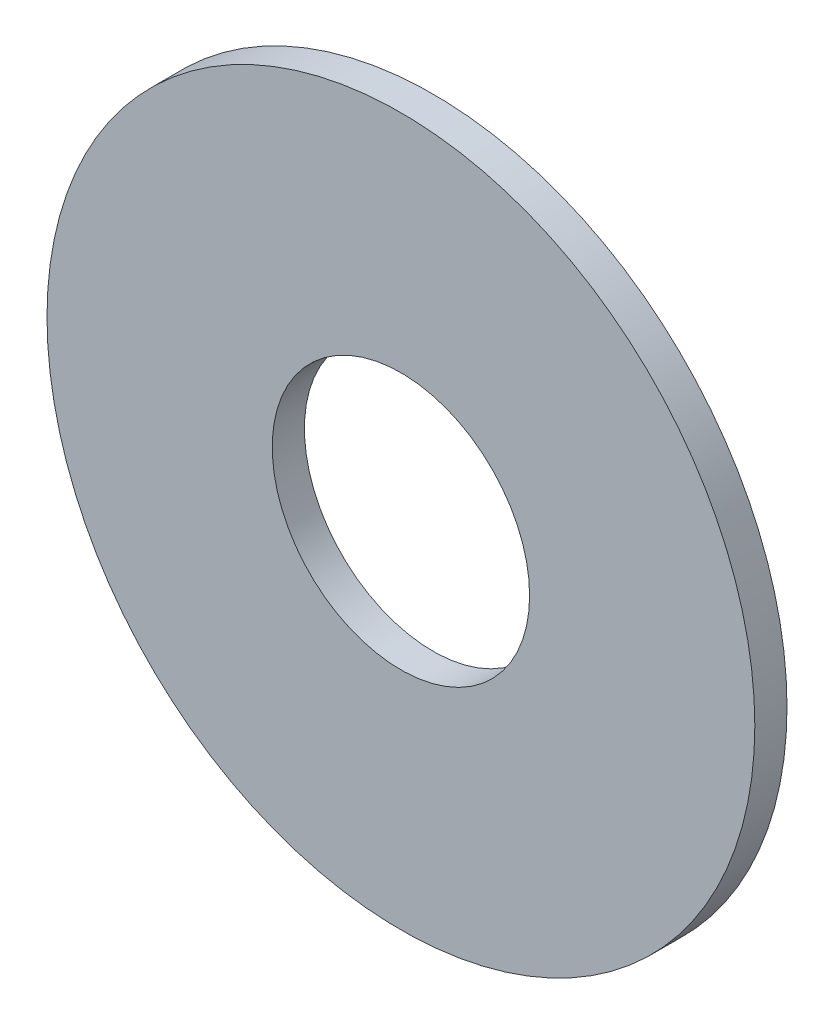
ISO-10303-21;
HEADER;
FILE_DESCRIPTION(('STEP AP214'),'2;1');
FILE_NAME('part.step','',(''),(''),'','','');
FILE_SCHEMA(('AUTOMOTIVE_DESIGN { 1 0 10303 214 1 1 1 1 }'));
ENDSEC;
DATA;
#1=APPLICATION_CONTEXT('core data for automotive mechanical design processes');
#2=APPLICATION_PROTOCOL_DEFINITION('international standard','automotive_design',2000,#1);
#3=PRODUCT_CONTEXT('',#1,'mechanical');
#4=PRODUCT('Part','Part','',(#3));
#5=PRODUCT_RELATED_PRODUCT_CATEGORY('part','',(#4));
#6=PRODUCT_DEFINITION_FORMATION('','',#4);
#7=PRODUCT_DEFINITION_CONTEXT('part definition',#1,'design');
#8=PRODUCT_DEFINITION('design','',#6,#7);
#9=PRODUCT_DEFINITION_SHAPE('','',#8);
#10=(LENGTH_UNIT() NAMED_UNIT(*) SI_UNIT(.MILLI.,.METRE.));
#11=(NAMED_UNIT(*) PLANE_ANGLE_UNIT() SI_UNIT($,.RADIAN.));
#12=(NAMED_UNIT(*) SI_UNIT($,.STERADIAN.) SOLID_ANGLE_UNIT());
#13=UNCERTAINTY_MEASURE_WITH_UNIT(LENGTH_MEASURE(1.E-05),#10,'distance_accuracy_value','');
#14=(GEOMETRIC_REPRESENTATION_CONTEXT(3) GLOBAL_UNCERTAINTY_ASSIGNED_CONTEXT((#13)) GLOBAL_UNIT_ASSIGNED_CONTEXT((#10,
#11,#12)) REPRESENTATION_CONTEXT('',''));
#15=CARTESIAN_POINT('',(0.,0.,0.));
#16=DIRECTION('',(0.,0.,1.));
#17=DIRECTION('',(1.,0.,0.));
#18=AXIS2_PLACEMENT_3D('',#15,#16,#17);
#19=CARTESIAN_POINT('',(0.,0.,0.5));
#20=DIRECTION('',(0.,0.,1.));
#21=DIRECTION('',(1.,0.,0.));
#22=AXIS2_PLACEMENT_3D('',#19,#20,#21);
#23=PLANE('',#22);
#24=CARTESIAN_POINT('',(0.,0.,0.5));
#25=DIRECTION('',(0.,0.,1.));
#26=DIRECTION('',(1.,0.,0.));
#27=AXIS2_PLACEMENT_3D('',#24,#25,#26);
#28=CIRCLE('',#27,5.5);
#29=CARTESIAN_POINT('',(5.5,0.,0.5));
#30=VERTEX_POINT('',#29);
#31=EDGE_CURVE('E10',#30,#30,#28,.T.);
#32=ORIENTED_EDGE('',*,*,#31,.T.);
#33=EDGE_LOOP('',(#32));
#34=FACE_BOUND('',#33,.T.);
#35=CARTESIAN_POINT('',(0.,0.,0.5));
#36=DIRECTION('',(0.,0.,1.));
#37=DIRECTION('',(1.,0.,0.));
#38=AXIS2_PLACEMENT_3D('',#35,#36,#37);
#39=CIRCLE('',#38,2.);
#40=CARTESIAN_POINT('',(2.,0.,0.5));
#41=VERTEX_POINT('',#40);
#42=EDGE_CURVE('E46',#41,#41,#39,.T.);
#43=ORIENTED_EDGE('',*,*,#42,.F.);
#44=EDGE_LOOP('',(#43));
#45=FACE_BOUND('',#44,.T.);
#46=ADVANCED_FACE('F35',(#34,#45),#23,.T.);
#47=CARTESIAN_POINT('',(0.,0.,0.));
#48=DIRECTION('',(0.,0.,1.));
#49=DIRECTION('',(1.,0.,0.));
#50=AXIS2_PLACEMENT_3D('',#47,#48,#49);
#51=PLANE('',#50);
#52=CARTESIAN_POINT('',(0.,0.,0.));
#53=DIRECTION('',(0.,0.,1.));
#54=DIRECTION('',(1.,0.,0.));
#55=AXIS2_PLACEMENT_3D('',#52,#53,#54);
#56=CIRCLE('',#55,5.5);
#57=CARTESIAN_POINT('',(5.5,0.,0.));
#58=VERTEX_POINT('',#57);
#59=EDGE_CURVE('E39',#58,#58,#56,.T.);
#60=ORIENTED_EDGE('',*,*,#59,.F.);
#61=EDGE_LOOP('',(#60));
#62=FACE_BOUND('',#61,.T.);
#63=CARTESIAN_POINT('',(0.,0.,0.));
#64=DIRECTION('',(0.,0.,1.));
#65=DIRECTION('',(1.,0.,0.));
#66=AXIS2_PLACEMENT_3D('',#63,#64,#65);
#67=CIRCLE('',#66,2.);
#68=CARTESIAN_POINT('',(2.,0.,0.));
#69=VERTEX_POINT('',#68);
#70=EDGE_CURVE('E48',#69,#69,#67,.T.);
#71=ORIENTED_EDGE('',*,*,#70,.T.);
#72=EDGE_LOOP('',(#71));
#73=FACE_BOUND('',#72,.T.);
#74=ADVANCED_FACE('F58',(#62,#73),#51,.F.);
#75=CARTESIAN_POINT('',(0.,0.,0.5));
#76=DIRECTION('',(0.,0.,-1.));
#77=DIRECTION('',(-1.,0.,0.));
#78=AXIS2_PLACEMENT_3D('',#75,#76,#77);
#79=CYLINDRICAL_SURFACE('',#78,5.5);
#80=ORIENTED_EDGE('',*,*,#31,.F.);
#81=EDGE_LOOP('',(#80));
#82=FACE_BOUND('',#81,.T.);
#83=ORIENTED_EDGE('',*,*,#59,.T.);
#84=EDGE_LOOP('',(#83));
#85=FACE_BOUND('',#84,.T.);
#86=ADVANCED_FACE('F37',(#82,#85),#79,.T.);
#87=CARTESIAN_POINT('',(0.,0.,0.5));
#88=DIRECTION('',(0.,0.,-1.));
#89=DIRECTION('',(-1.,0.,0.));
#90=AXIS2_PLACEMENT_3D('',#87,#88,#89);
#91=CYLINDRICAL_SURFACE('',#90,2.);
#92=ORIENTED_EDGE('',*,*,#42,.T.);
#93=EDGE_LOOP('',(#92));
#94=FACE_BOUND('',#93,.T.);
#95=ORIENTED_EDGE('',*,*,#70,.F.);
#96=EDGE_LOOP('',(#95));
#97=FACE_BOUND('',#96,.T.);
#98=ADVANCED_FACE('F54',(#94,#97),#91,.F.);
#99=CLOSED_SHELL('',(#46,#74,#86,#98));
#100=MANIFOLD_SOLID_BREP('B2',#99);
#101=ADVANCED_BREP_SHAPE_REPRESENTATION('',(#18,#100),#14);
#102=SHAPE_DEFINITION_REPRESENTATION(#9,#101);
ENDSEC;
END-ISO-10303-21;
